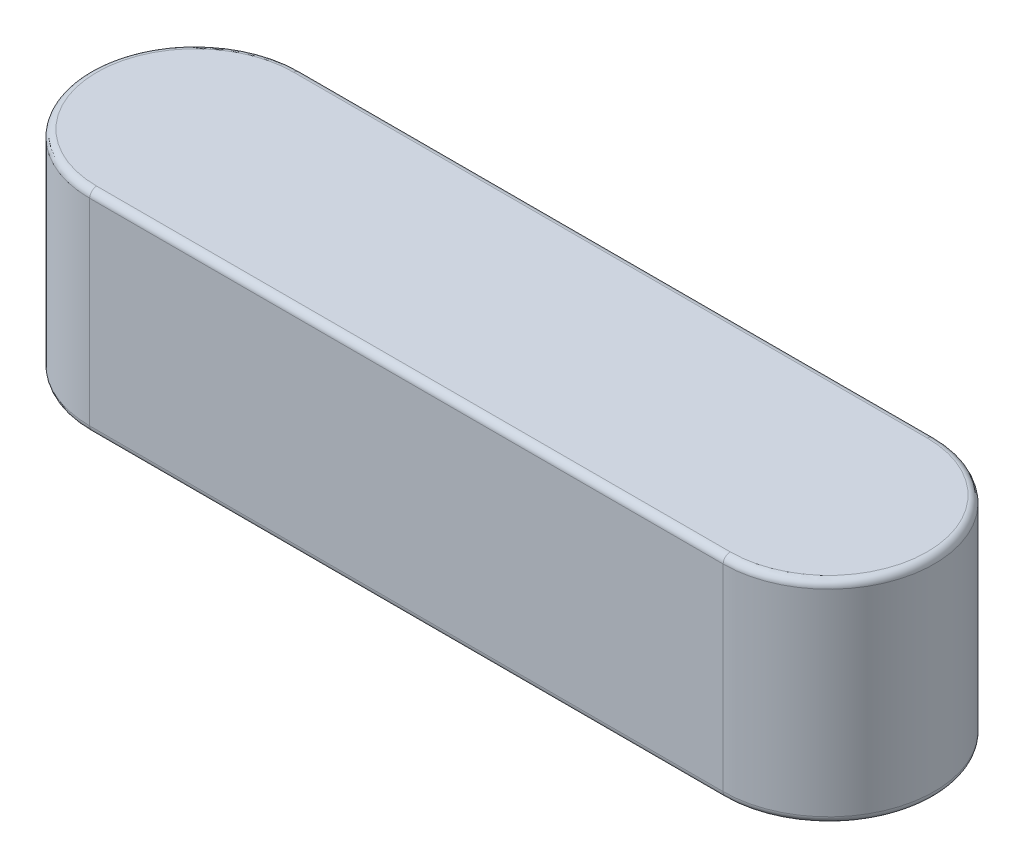
ISO-10303-21;
HEADER;
FILE_DESCRIPTION(('STEP AP214'),'2;1');
FILE_NAME('part.step','',(''),(''),'','','');
FILE_SCHEMA(('AUTOMOTIVE_DESIGN { 1 0 10303 214 1 1 1 1 }'));
ENDSEC;
DATA;
#1=APPLICATION_CONTEXT('core data for automotive mechanical design processes');
#2=APPLICATION_PROTOCOL_DEFINITION('international standard','automotive_design',2000,#1);
#3=PRODUCT_CONTEXT('',#1,'mechanical');
#4=PRODUCT('Part','Part','',(#3));
#5=PRODUCT_RELATED_PRODUCT_CATEGORY('part','',(#4));
#6=PRODUCT_DEFINITION_FORMATION('','',#4);
#7=PRODUCT_DEFINITION_CONTEXT('part definition',#1,'design');
#8=PRODUCT_DEFINITION('design','',#6,#7);
#9=PRODUCT_DEFINITION_SHAPE('','',#8);
#10=(LENGTH_UNIT() NAMED_UNIT(*) SI_UNIT(.MILLI.,.METRE.));
#11=(NAMED_UNIT(*) PLANE_ANGLE_UNIT() SI_UNIT($,.RADIAN.));
#12=(NAMED_UNIT(*) SI_UNIT($,.STERADIAN.) SOLID_ANGLE_UNIT());
#13=UNCERTAINTY_MEASURE_WITH_UNIT(LENGTH_MEASURE(1.E-05),#10,'distance_accuracy_value','');
#14=(GEOMETRIC_REPRESENTATION_CONTEXT(3) GLOBAL_UNCERTAINTY_ASSIGNED_CONTEXT((#13)) GLOBAL_UNIT_ASSIGNED_CONTEXT((#10,
#11,#12)) REPRESENTATION_CONTEXT('',''));
#15=CARTESIAN_POINT('',(0.,0.,0.));
#16=DIRECTION('',(0.,0.,1.));
#17=DIRECTION('',(1.,0.,0.));
#18=AXIS2_PLACEMENT_3D('',#15,#16,#17);
#19=CARTESIAN_POINT('',(4.49999999999999,3.,0.));
#20=DIRECTION('',(0.,-1.,0.));
#21=DIRECTION('',(0.,0.,-1.));
#22=AXIS2_PLACEMENT_3D('',#19,#20,#21);
#23=CYLINDRICAL_SURFACE('',#22,1.50000000000002);
#24=DIRECTION('',(0.,-1.,0.));
#25=VECTOR('',#24,1.);
#26=CARTESIAN_POINT('',(4.49999999999999,3.,1.50000000000002));
#27=LINE('',#26,#25);
#28=CARTESIAN_POINT('',(4.49999999999999,2.9,1.50000000000002));
#29=VERTEX_POINT('',#28);
#30=CARTESIAN_POINT('',(4.49999999999999,0.0999999999999998,1.50000000000002));
#31=VERTEX_POINT('',#30);
#32=EDGE_CURVE('E109',#29,#31,#27,.T.);
#33=ORIENTED_EDGE('',*,*,#32,.T.);
#34=CARTESIAN_POINT('',(4.49999999999999,0.0999999999999998,0.));
#35=DIRECTION('',(0.,1.,0.));
#36=DIRECTION('',(0.,0.,1.));
#37=AXIS2_PLACEMENT_3D('',#34,#35,#36);
#38=CIRCLE('',#37,1.50000000000002);
#39=CARTESIAN_POINT('',(4.49999999999999,0.0999999999999998,-1.50000000000002));
#40=VERTEX_POINT('',#39);
#41=EDGE_CURVE('E204',#31,#40,#38,.T.);
#42=ORIENTED_EDGE('',*,*,#41,.T.);
#43=DIRECTION('',(0.,-1.,0.));
#44=VECTOR('',#43,1.);
#45=CARTESIAN_POINT('',(4.49999999999999,3.,-1.50000000000002));
#46=LINE('',#45,#44);
#47=CARTESIAN_POINT('',(4.49999999999999,2.9,-1.50000000000002));
#48=VERTEX_POINT('',#47);
#49=EDGE_CURVE('E138',#48,#40,#46,.T.);
#50=ORIENTED_EDGE('',*,*,#49,.F.);
#51=CARTESIAN_POINT('',(4.49999999999999,2.9,0.));
#52=DIRECTION('',(0.,1.,0.));
#53=DIRECTION('',(0.,0.,1.));
#54=AXIS2_PLACEMENT_3D('',#51,#52,#53);
#55=CIRCLE('',#54,1.50000000000002);
#56=EDGE_CURVE('E201',#48,#29,#55,.F.);
#57=ORIENTED_EDGE('',*,*,#56,.T.);
#58=EDGE_LOOP('',(#33,#42,#50,#57));
#59=FACE_BOUND('',#58,.T.);
#60=ADVANCED_FACE('F37',(#59),#23,.T.);
#61=CARTESIAN_POINT('',(4.49999999999999,3.,-1.50000000000002));
#62=DIRECTION('',(0.,0.,1.));
#63=DIRECTION('',(1.,0.,0.));
#64=AXIS2_PLACEMENT_3D('',#61,#62,#63);
#65=PLANE('',#64);
#66=ORIENTED_EDGE('',*,*,#49,.T.);
#67=DIRECTION('',(-1.,0.,0.));
#68=VECTOR('',#67,1.);
#69=CARTESIAN_POINT('',(4.49999999999999,0.0999999999999998,-1.50000000000002));
#70=LINE('',#69,#68);
#71=CARTESIAN_POINT('',(-4.49999999999999,0.0999999999999998,-1.50000000000001));
#72=VERTEX_POINT('',#71);
#73=EDGE_CURVE('E198',#40,#72,#70,.T.);
#74=ORIENTED_EDGE('',*,*,#73,.T.);
#75=DIRECTION('',(0.,-1.,0.));
#76=VECTOR('',#75,1.);
#77=CARTESIAN_POINT('',(-4.49999999999999,3.,-1.50000000000001));
#78=LINE('',#77,#76);
#79=CARTESIAN_POINT('',(-4.49999999999999,2.9,-1.50000000000001));
#80=VERTEX_POINT('',#79);
#81=EDGE_CURVE('E128',#80,#72,#78,.T.);
#82=ORIENTED_EDGE('',*,*,#81,.F.);
#83=DIRECTION('',(-1.,0.,0.));
#84=VECTOR('',#83,1.);
#85=CARTESIAN_POINT('',(4.49999999999999,2.9,-1.50000000000002));
#86=LINE('',#85,#84);
#87=EDGE_CURVE('E195',#80,#48,#86,.F.);
#88=ORIENTED_EDGE('',*,*,#87,.T.);
#89=EDGE_LOOP('',(#66,#74,#82,#88));
#90=FACE_BOUND('',#89,.T.);
#91=ADVANCED_FACE('F221',(#90),#65,.F.);
#92=CARTESIAN_POINT('',(-4.49999999999999,3.,0.));
#93=DIRECTION('',(0.,-1.,0.));
#94=DIRECTION('',(0.,0.,-1.));
#95=AXIS2_PLACEMENT_3D('',#92,#93,#94);
#96=CYLINDRICAL_SURFACE('',#95,1.50000000000002);
#97=ORIENTED_EDGE('',*,*,#81,.T.);
#98=CARTESIAN_POINT('',(-4.49999999999999,0.0999999999999998,0.));
#99=DIRECTION('',(0.,1.,0.));
#100=DIRECTION('',(0.,0.,1.));
#101=AXIS2_PLACEMENT_3D('',#98,#99,#100);
#102=CIRCLE('',#101,1.50000000000002);
#103=CARTESIAN_POINT('',(-4.49999999999999,0.0999999999999998,1.50000000000002));
#104=VERTEX_POINT('',#103);
#105=EDGE_CURVE('E126',#72,#104,#102,.T.);
#106=ORIENTED_EDGE('',*,*,#105,.T.);
#107=DIRECTION('',(0.,-1.,0.));
#108=VECTOR('',#107,1.);
#109=CARTESIAN_POINT('',(-4.49999999999999,3.,1.50000000000002));
#110=LINE('',#109,#108);
#111=CARTESIAN_POINT('',(-4.49999999999999,2.9,1.50000000000002));
#112=VERTEX_POINT('',#111);
#113=EDGE_CURVE('E107',#112,#104,#110,.T.);
#114=ORIENTED_EDGE('',*,*,#113,.F.);
#115=CARTESIAN_POINT('',(-4.49999999999999,2.9,0.));
#116=DIRECTION('',(0.,1.,0.));
#117=DIRECTION('',(0.,0.,1.));
#118=AXIS2_PLACEMENT_3D('',#115,#116,#117);
#119=CIRCLE('',#118,1.50000000000002);
#120=EDGE_CURVE('E123',#112,#80,#119,.F.);
#121=ORIENTED_EDGE('',*,*,#120,.T.);
#122=EDGE_LOOP('',(#97,#106,#114,#121));
#123=FACE_BOUND('',#122,.T.);
#124=ADVANCED_FACE('F122',(#123),#96,.T.);
#125=CARTESIAN_POINT('',(4.49999999999999,3.,1.50000000000002));
#126=DIRECTION('',(0.,0.,-1.));
#127=DIRECTION('',(-1.,0.,0.));
#128=AXIS2_PLACEMENT_3D('',#125,#126,#127);
#129=PLANE('',#128);
#130=ORIENTED_EDGE('',*,*,#113,.T.);
#131=DIRECTION('',(1.,0.,0.));
#132=VECTOR('',#131,1.);
#133=CARTESIAN_POINT('',(4.49999999999999,0.0999999999999998,1.50000000000002));
#134=LINE('',#133,#132);
#135=EDGE_CURVE('E11',#104,#31,#134,.T.);
#136=ORIENTED_EDGE('',*,*,#135,.T.);
#137=ORIENTED_EDGE('',*,*,#32,.F.);
#138=DIRECTION('',(1.,0.,0.));
#139=VECTOR('',#138,1.);
#140=CARTESIAN_POINT('',(-4.49999999999999,2.9,1.50000000000002));
#141=LINE('',#140,#139);
#142=EDGE_CURVE('E47',#29,#112,#141,.F.);
#143=ORIENTED_EDGE('',*,*,#142,.T.);
#144=EDGE_LOOP('',(#130,#136,#137,#143));
#145=FACE_BOUND('',#144,.T.);
#146=ADVANCED_FACE('F106',(#145),#129,.F.);
#147=CARTESIAN_POINT('',(4.49999999999999,3.,0.));
#148=DIRECTION('',(0.,1.,0.));
#149=DIRECTION('',(0.,0.,1.));
#150=AXIS2_PLACEMENT_3D('',#147,#148,#149);
#151=PLANE('',#150);
#152=DIRECTION('',(-1.,0.,0.));
#153=VECTOR('',#152,1.);
#154=CARTESIAN_POINT('',(-4.49999999999999,3.,-1.40000000000002));
#155=LINE('',#154,#153);
#156=CARTESIAN_POINT('',(4.49999999999999,3.,-1.4));
#157=VERTEX_POINT('',#156);
#158=CARTESIAN_POINT('',(-4.49999999999999,3.,-1.40000000000002));
#159=VERTEX_POINT('',#158);
#160=EDGE_CURVE('E55',#157,#159,#155,.T.);
#161=ORIENTED_EDGE('',*,*,#160,.T.);
#162=CARTESIAN_POINT('',(-4.49999999999999,3.,0.));
#163=DIRECTION('',(0.,1.,0.));
#164=DIRECTION('',(0.,0.,1.));
#165=AXIS2_PLACEMENT_3D('',#162,#163,#164);
#166=CIRCLE('',#165,1.40000000000002);
#167=CARTESIAN_POINT('',(-4.49999999999999,3.,1.40000000000002));
#168=VERTEX_POINT('',#167);
#169=EDGE_CURVE('E115',#159,#168,#166,.T.);
#170=ORIENTED_EDGE('',*,*,#169,.T.);
#171=DIRECTION('',(1.,0.,0.));
#172=VECTOR('',#171,1.);
#173=CARTESIAN_POINT('',(4.49999999999999,3.,1.40000000000002));
#174=LINE('',#173,#172);
#175=CARTESIAN_POINT('',(4.49999999999999,3.,1.40000000000002));
#176=VERTEX_POINT('',#175);
#177=EDGE_CURVE('E141',#168,#176,#174,.T.);
#178=ORIENTED_EDGE('',*,*,#177,.T.);
#179=CARTESIAN_POINT('',(4.49999999999999,3.,0.));
#180=DIRECTION('',(0.,1.,0.));
#181=DIRECTION('',(0.,0.,1.));
#182=AXIS2_PLACEMENT_3D('',#179,#180,#181);
#183=CIRCLE('',#182,1.40000000000002);
#184=EDGE_CURVE('E60',#176,#157,#183,.T.);
#185=ORIENTED_EDGE('',*,*,#184,.T.);
#186=EDGE_LOOP('',(#161,#170,#178,#185));
#187=FACE_BOUND('',#186,.T.);
#188=ADVANCED_FACE('F215',(#187),#151,.T.);
#189=CARTESIAN_POINT('',(4.49999999999999,0.,0.));
#190=DIRECTION('',(0.,1.,0.));
#191=DIRECTION('',(0.,0.,1.));
#192=AXIS2_PLACEMENT_3D('',#189,#190,#191);
#193=PLANE('',#192);
#194=DIRECTION('',(1.,0.,0.));
#195=VECTOR('',#194,1.);
#196=CARTESIAN_POINT('',(4.49999999999999,0.,1.40000000000002));
#197=LINE('',#196,#195);
#198=CARTESIAN_POINT('',(4.49999999999999,0.,1.40000000000002));
#199=VERTEX_POINT('',#198);
#200=CARTESIAN_POINT('',(-4.49999999999999,0.,1.40000000000002));
#201=VERTEX_POINT('',#200);
#202=EDGE_CURVE('E183',#199,#201,#197,.F.);
#203=ORIENTED_EDGE('',*,*,#202,.T.);
#204=CARTESIAN_POINT('',(-4.49999999999999,0.,0.));
#205=DIRECTION('',(0.,1.,0.));
#206=DIRECTION('',(0.,0.,1.));
#207=AXIS2_PLACEMENT_3D('',#204,#205,#206);
#208=CIRCLE('',#207,1.40000000000002);
#209=CARTESIAN_POINT('',(-4.49999999999999,0.,-1.40000000000002));
#210=VERTEX_POINT('',#209);
#211=EDGE_CURVE('E191',#201,#210,#208,.F.);
#212=ORIENTED_EDGE('',*,*,#211,.T.);
#213=DIRECTION('',(-1.,0.,0.));
#214=VECTOR('',#213,1.);
#215=CARTESIAN_POINT('',(4.49999999999999,0.,-1.40000000000002));
#216=LINE('',#215,#214);
#217=CARTESIAN_POINT('',(4.49999999999999,0.,-1.4));
#218=VERTEX_POINT('',#217);
#219=EDGE_CURVE('E188',#210,#218,#216,.F.);
#220=ORIENTED_EDGE('',*,*,#219,.T.);
#221=CARTESIAN_POINT('',(4.49999999999999,0.,0.));
#222=DIRECTION('',(0.,1.,0.));
#223=DIRECTION('',(0.,0.,1.));
#224=AXIS2_PLACEMENT_3D('',#221,#222,#223);
#225=CIRCLE('',#224,1.40000000000002);
#226=EDGE_CURVE('E185',#218,#199,#225,.F.);
#227=ORIENTED_EDGE('',*,*,#226,.T.);
#228=EDGE_LOOP('',(#203,#212,#220,#227));
#229=FACE_BOUND('',#228,.T.);
#230=ADVANCED_FACE('F247',(#229),#193,.F.);
#231=CARTESIAN_POINT('',(4.49999999999999,0.0999999999999998,0.));
#232=DIRECTION('',(0.,1.,0.));
#233=DIRECTION('',(0.,0.,1.));
#234=AXIS2_PLACEMENT_3D('',#231,#232,#233);
#235=TOROIDAL_SURFACE('',#234,1.40000000000002,0.1);
#236=CARTESIAN_POINT('',(4.49999999999999,0.1,1.40000000000004));
#237=DIRECTION('',(-1.,0.,0.));
#238=DIRECTION('',(0.,0.,1.));
#239=AXIS2_PLACEMENT_3D('',#236,#237,#238);
#240=CIRCLE('',#239,0.1);
#241=EDGE_CURVE('E157',#199,#31,#240,.T.);
#242=ORIENTED_EDGE('',*,*,#241,.F.);
#243=ORIENTED_EDGE('',*,*,#226,.F.);
#244=CARTESIAN_POINT('',(4.49999999999999,0.0999999999999998,-1.4));
#245=DIRECTION('',(-1.,0.,0.));
#246=DIRECTION('',(0.,0.,1.));
#247=AXIS2_PLACEMENT_3D('',#244,#245,#246);
#248=CIRCLE('',#247,0.1);
#249=EDGE_CURVE('E146',#40,#218,#248,.T.);
#250=ORIENTED_EDGE('',*,*,#249,.F.);
#251=ORIENTED_EDGE('',*,*,#41,.F.);
#252=EDGE_LOOP('',(#242,#243,#250,#251));
#253=FACE_BOUND('',#252,.T.);
#254=ADVANCED_FACE('F223',(#253),#235,.T.);
#255=CARTESIAN_POINT('',(4.49999999999999,0.0999999999999998,-1.40000000000002));
#256=DIRECTION('',(-1.,0.,0.));
#257=DIRECTION('',(0.,0.,1.));
#258=AXIS2_PLACEMENT_3D('',#255,#256,#257);
#259=CYLINDRICAL_SURFACE('',#258,0.1);
#260=ORIENTED_EDGE('',*,*,#249,.T.);
#261=ORIENTED_EDGE('',*,*,#219,.F.);
#262=CARTESIAN_POINT('',(-4.49999999999999,0.0999999999999998,-1.40000000000002));
#263=DIRECTION('',(-1.,0.,0.));
#264=DIRECTION('',(0.,0.,1.));
#265=AXIS2_PLACEMENT_3D('',#262,#263,#264);
#266=CIRCLE('',#265,0.1);
#267=EDGE_CURVE('E151',#72,#210,#266,.T.);
#268=ORIENTED_EDGE('',*,*,#267,.F.);
#269=ORIENTED_EDGE('',*,*,#73,.F.);
#270=EDGE_LOOP('',(#260,#261,#268,#269));
#271=FACE_BOUND('',#270,.T.);
#272=ADVANCED_FACE('F226',(#271),#259,.T.);
#273=CARTESIAN_POINT('',(4.49999999999999,0.0999999999999998,1.40000000000002));
#274=DIRECTION('',(1.,0.,0.));
#275=DIRECTION('',(0.,0.,-1.));
#276=AXIS2_PLACEMENT_3D('',#273,#274,#275);
#277=CYLINDRICAL_SURFACE('',#276,0.1);
#278=ORIENTED_EDGE('',*,*,#241,.T.);
#279=ORIENTED_EDGE('',*,*,#135,.F.);
#280=CARTESIAN_POINT('',(-4.49999999999999,0.1,1.40000000000002));
#281=DIRECTION('',(-1.,0.,0.));
#282=DIRECTION('',(0.,0.,1.));
#283=AXIS2_PLACEMENT_3D('',#280,#281,#282);
#284=CIRCLE('',#283,0.1);
#285=EDGE_CURVE('E149',#201,#104,#284,.T.);
#286=ORIENTED_EDGE('',*,*,#285,.F.);
#287=ORIENTED_EDGE('',*,*,#202,.F.);
#288=EDGE_LOOP('',(#278,#279,#286,#287));
#289=FACE_BOUND('',#288,.T.);
#290=ADVANCED_FACE('F229',(#289),#277,.T.);
#291=CARTESIAN_POINT('',(-4.49999999999999,0.0999999999999998,0.));
#292=DIRECTION('',(0.,1.,0.));
#293=DIRECTION('',(0.,0.,1.));
#294=AXIS2_PLACEMENT_3D('',#291,#292,#293);
#295=TOROIDAL_SURFACE('',#294,1.40000000000002,0.1);
#296=ORIENTED_EDGE('',*,*,#267,.T.);
#297=ORIENTED_EDGE('',*,*,#211,.F.);
#298=ORIENTED_EDGE('',*,*,#285,.T.);
#299=ORIENTED_EDGE('',*,*,#105,.F.);
#300=EDGE_LOOP('',(#296,#297,#298,#299));
#301=FACE_BOUND('',#300,.T.);
#302=ADVANCED_FACE('F227',(#301),#295,.T.);
#303=CARTESIAN_POINT('',(4.49999999999999,2.9,0.));
#304=DIRECTION('',(0.,1.,0.));
#305=DIRECTION('',(0.,0.,1.));
#306=AXIS2_PLACEMENT_3D('',#303,#304,#305);
#307=TOROIDAL_SURFACE('',#306,1.40000000000002,0.1);
#308=CARTESIAN_POINT('',(4.49999999999999,2.9,1.40000000000004));
#309=DIRECTION('',(-1.,0.,0.));
#310=DIRECTION('',(0.,0.,1.));
#311=AXIS2_PLACEMENT_3D('',#308,#309,#310);
#312=CIRCLE('',#311,0.1);
#313=EDGE_CURVE('E143',#29,#176,#312,.T.);
#314=ORIENTED_EDGE('',*,*,#313,.F.);
#315=ORIENTED_EDGE('',*,*,#56,.F.);
#316=CARTESIAN_POINT('',(4.49999999999999,2.9,-1.4));
#317=DIRECTION('',(-1.,0.,0.));
#318=DIRECTION('',(0.,0.,1.));
#319=AXIS2_PLACEMENT_3D('',#316,#317,#318);
#320=CIRCLE('',#319,0.1);
#321=EDGE_CURVE('E41',#157,#48,#320,.T.);
#322=ORIENTED_EDGE('',*,*,#321,.F.);
#323=ORIENTED_EDGE('',*,*,#184,.F.);
#324=EDGE_LOOP('',(#314,#315,#322,#323));
#325=FACE_BOUND('',#324,.T.);
#326=ADVANCED_FACE('F39',(#325),#307,.T.);
#327=CARTESIAN_POINT('',(4.49999999999999,2.9,-1.40000000000002));
#328=DIRECTION('',(1.,0.,0.));
#329=DIRECTION('',(0.,0.,-1.));
#330=AXIS2_PLACEMENT_3D('',#327,#328,#329);
#331=CYLINDRICAL_SURFACE('',#330,0.1);
#332=ORIENTED_EDGE('',*,*,#321,.T.);
#333=ORIENTED_EDGE('',*,*,#87,.F.);
#334=CARTESIAN_POINT('',(-4.49999999999999,2.9,-1.40000000000002));
#335=DIRECTION('',(-1.,0.,0.));
#336=DIRECTION('',(0.,0.,1.));
#337=AXIS2_PLACEMENT_3D('',#334,#335,#336);
#338=CIRCLE('',#337,0.1);
#339=EDGE_CURVE('E135',#159,#80,#338,.T.);
#340=ORIENTED_EDGE('',*,*,#339,.F.);
#341=ORIENTED_EDGE('',*,*,#160,.F.);
#342=EDGE_LOOP('',(#332,#333,#340,#341));
#343=FACE_BOUND('',#342,.T.);
#344=ADVANCED_FACE('F218',(#343),#331,.T.);
#345=CARTESIAN_POINT('',(4.49999999999999,2.9,1.40000000000002));
#346=DIRECTION('',(-1.,0.,0.));
#347=DIRECTION('',(0.,0.,1.));
#348=AXIS2_PLACEMENT_3D('',#345,#346,#347);
#349=CYLINDRICAL_SURFACE('',#348,0.1);
#350=ORIENTED_EDGE('',*,*,#313,.T.);
#351=ORIENTED_EDGE('',*,*,#177,.F.);
#352=CARTESIAN_POINT('',(-4.49999999999999,2.9,1.40000000000002));
#353=DIRECTION('',(-1.,0.,0.));
#354=DIRECTION('',(0.,0.,1.));
#355=AXIS2_PLACEMENT_3D('',#352,#353,#354);
#356=CIRCLE('',#355,0.1);
#357=EDGE_CURVE('E133',#112,#168,#356,.T.);
#358=ORIENTED_EDGE('',*,*,#357,.F.);
#359=ORIENTED_EDGE('',*,*,#142,.F.);
#360=EDGE_LOOP('',(#350,#351,#358,#359));
#361=FACE_BOUND('',#360,.T.);
#362=ADVANCED_FACE('F140',(#361),#349,.T.);
#363=CARTESIAN_POINT('',(-4.49999999999999,2.9,0.));
#364=DIRECTION('',(0.,1.,0.));
#365=DIRECTION('',(0.,0.,1.));
#366=AXIS2_PLACEMENT_3D('',#363,#364,#365);
#367=TOROIDAL_SURFACE('',#366,1.40000000000002,0.1);
#368=ORIENTED_EDGE('',*,*,#339,.T.);
#369=ORIENTED_EDGE('',*,*,#120,.F.);
#370=ORIENTED_EDGE('',*,*,#357,.T.);
#371=ORIENTED_EDGE('',*,*,#169,.F.);
#372=EDGE_LOOP('',(#368,#369,#370,#371));
#373=FACE_BOUND('',#372,.T.);
#374=ADVANCED_FACE('F131',(#373),#367,.T.);
#375=CLOSED_SHELL('',(#60,#91,#124,#146,#188,#230,#254,#272,#290,#302,#326,#344,#362,#374));
#376=MANIFOLD_SOLID_BREP('B2',#375);
#377=ADVANCED_BREP_SHAPE_REPRESENTATION('',(#18,#376),#14);
#378=SHAPE_DEFINITION_REPRESENTATION(#9,#377);
ENDSEC;
END-ISO-10303-21;
